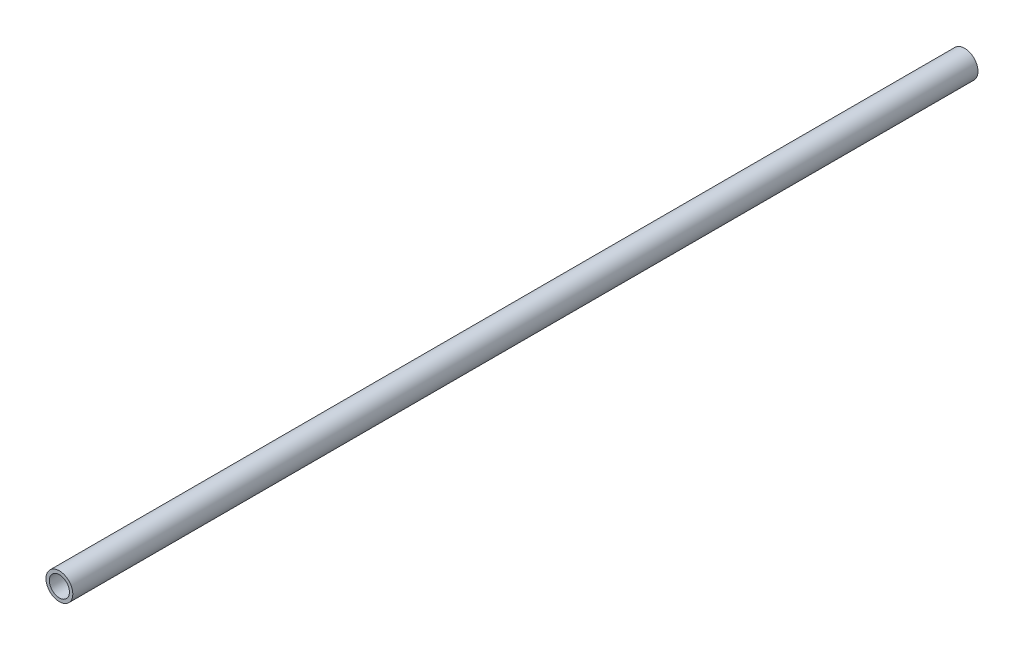
ISO-10303-21;
HEADER;
FILE_DESCRIPTION(('STEP AP214'),'2;1');
FILE_NAME('part.step','',(''),(''),'','','');
FILE_SCHEMA(('AUTOMOTIVE_DESIGN { 1 0 10303 214 1 1 1 1 }'));
ENDSEC;
DATA;
#1=APPLICATION_CONTEXT('core data for automotive mechanical design processes');
#2=APPLICATION_PROTOCOL_DEFINITION('international standard','automotive_design',2000,#1);
#3=PRODUCT_CONTEXT('',#1,'mechanical');
#4=PRODUCT('Part','Part','',(#3));
#5=PRODUCT_RELATED_PRODUCT_CATEGORY('part','',(#4));
#6=PRODUCT_DEFINITION_FORMATION('','',#4);
#7=PRODUCT_DEFINITION_CONTEXT('part definition',#1,'design');
#8=PRODUCT_DEFINITION('design','',#6,#7);
#9=PRODUCT_DEFINITION_SHAPE('','',#8);
#10=(LENGTH_UNIT() NAMED_UNIT(*) SI_UNIT(.MILLI.,.METRE.));
#11=(NAMED_UNIT(*) PLANE_ANGLE_UNIT() SI_UNIT($,.RADIAN.));
#12=(NAMED_UNIT(*) SI_UNIT($,.STERADIAN.) SOLID_ANGLE_UNIT());
#13=UNCERTAINTY_MEASURE_WITH_UNIT(LENGTH_MEASURE(1.E-05),#10,'distance_accuracy_value','');
#14=(GEOMETRIC_REPRESENTATION_CONTEXT(3) GLOBAL_UNCERTAINTY_ASSIGNED_CONTEXT((#13)) GLOBAL_UNIT_ASSIGNED_CONTEXT((#10,
#11,#12)) REPRESENTATION_CONTEXT('',''));
#15=CARTESIAN_POINT('',(0.,0.,0.));
#16=DIRECTION('',(0.,0.,1.));
#17=DIRECTION('',(1.,0.,0.));
#18=AXIS2_PLACEMENT_3D('',#15,#16,#17);
#19=CARTESIAN_POINT('',(0.,0.,270.));
#20=DIRECTION('',(0.,0.,1.));
#21=DIRECTION('',(1.,0.,0.));
#22=AXIS2_PLACEMENT_3D('',#19,#20,#21);
#23=PLANE('',#22);
#24=CARTESIAN_POINT('',(0.,0.,270.));
#25=DIRECTION('',(0.,0.,1.));
#26=DIRECTION('',(1.,0.,0.));
#27=AXIS2_PLACEMENT_3D('',#24,#25,#26);
#28=CIRCLE('',#27,8.);
#29=CARTESIAN_POINT('',(8.,0.,270.));
#30=VERTEX_POINT('',#29);
#31=EDGE_CURVE('E10',#30,#30,#28,.T.);
#32=ORIENTED_EDGE('',*,*,#31,.T.);
#33=EDGE_LOOP('',(#32));
#34=FACE_BOUND('',#33,.T.);
#35=CARTESIAN_POINT('',(0.,0.,270.));
#36=DIRECTION('',(0.,0.,1.));
#37=DIRECTION('',(1.,0.,0.));
#38=AXIS2_PLACEMENT_3D('',#35,#36,#37);
#39=CIRCLE('',#38,6.);
#40=CARTESIAN_POINT('',(6.,0.,270.));
#41=VERTEX_POINT('',#40);
#42=EDGE_CURVE('E48',#41,#41,#39,.T.);
#43=ORIENTED_EDGE('',*,*,#42,.F.);
#44=EDGE_LOOP('',(#43));
#45=FACE_BOUND('',#44,.T.);
#46=ADVANCED_FACE('F37',(#34,#45),#23,.T.);
#47=CARTESIAN_POINT('',(0.,0.,-270.));
#48=DIRECTION('',(0.,0.,1.));
#49=DIRECTION('',(1.,0.,0.));
#50=AXIS2_PLACEMENT_3D('',#47,#48,#49);
#51=PLANE('',#50);
#52=CARTESIAN_POINT('',(0.,0.,-270.));
#53=DIRECTION('',(0.,0.,1.));
#54=DIRECTION('',(1.,0.,0.));
#55=AXIS2_PLACEMENT_3D('',#52,#53,#54);
#56=CIRCLE('',#55,8.);
#57=CARTESIAN_POINT('',(8.,0.,-270.));
#58=VERTEX_POINT('',#57);
#59=EDGE_CURVE('E41',#58,#58,#56,.T.);
#60=ORIENTED_EDGE('',*,*,#59,.F.);
#61=EDGE_LOOP('',(#60));
#62=FACE_BOUND('',#61,.T.);
#63=CARTESIAN_POINT('',(0.,0.,-270.));
#64=DIRECTION('',(0.,0.,1.));
#65=DIRECTION('',(1.,0.,0.));
#66=AXIS2_PLACEMENT_3D('',#63,#64,#65);
#67=CIRCLE('',#66,6.);
#68=CARTESIAN_POINT('',(6.,0.,-270.));
#69=VERTEX_POINT('',#68);
#70=EDGE_CURVE('E50',#69,#69,#67,.T.);
#71=ORIENTED_EDGE('',*,*,#70,.T.);
#72=EDGE_LOOP('',(#71));
#73=FACE_BOUND('',#72,.T.);
#74=ADVANCED_FACE('F60',(#62,#73),#51,.F.);
#75=CARTESIAN_POINT('',(0.,0.,270.));
#76=DIRECTION('',(0.,0.,-1.));
#77=DIRECTION('',(-1.,0.,0.));
#78=AXIS2_PLACEMENT_3D('',#75,#76,#77);
#79=CYLINDRICAL_SURFACE('',#78,8.);
#80=ORIENTED_EDGE('',*,*,#31,.F.);
#81=EDGE_LOOP('',(#80));
#82=FACE_BOUND('',#81,.T.);
#83=ORIENTED_EDGE('',*,*,#59,.T.);
#84=EDGE_LOOP('',(#83));
#85=FACE_BOUND('',#84,.T.);
#86=ADVANCED_FACE('F39',(#82,#85),#79,.T.);
#87=CARTESIAN_POINT('',(0.,0.,270.));
#88=DIRECTION('',(0.,0.,-1.));
#89=DIRECTION('',(-1.,0.,0.));
#90=AXIS2_PLACEMENT_3D('',#87,#88,#89);
#91=CYLINDRICAL_SURFACE('',#90,6.);
#92=ORIENTED_EDGE('',*,*,#42,.T.);
#93=EDGE_LOOP('',(#92));
#94=FACE_BOUND('',#93,.T.);
#95=ORIENTED_EDGE('',*,*,#70,.F.);
#96=EDGE_LOOP('',(#95));
#97=FACE_BOUND('',#96,.T.);
#98=ADVANCED_FACE('F56',(#94,#97),#91,.F.);
#99=CLOSED_SHELL('',(#46,#74,#86,#98));
#100=MANIFOLD_SOLID_BREP('B2',#99);
#101=ADVANCED_BREP_SHAPE_REPRESENTATION('',(#18,#100),#14);
#102=SHAPE_DEFINITION_REPRESENTATION(#9,#101);
ENDSEC;
END-ISO-10303-21;
